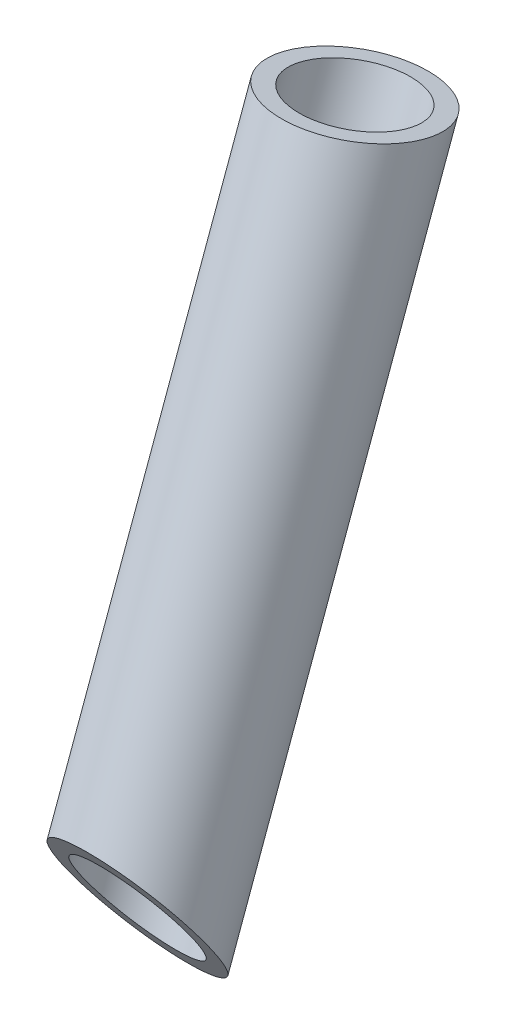
ISO-10303-21;
HEADER;
FILE_DESCRIPTION(('STEP AP214'),'2;1');
FILE_NAME('part.step','',(''),(''),'','','');
FILE_SCHEMA(('AUTOMOTIVE_DESIGN { 1 0 10303 214 1 1 1 1 }'));
ENDSEC;
DATA;
#1=APPLICATION_CONTEXT('core data for automotive mechanical design processes');
#2=APPLICATION_PROTOCOL_DEFINITION('international standard','automotive_design',2000,#1);
#3=PRODUCT_CONTEXT('',#1,'mechanical');
#4=PRODUCT('Part','Part','',(#3));
#5=PRODUCT_RELATED_PRODUCT_CATEGORY('part','',(#4));
#6=PRODUCT_DEFINITION_FORMATION('','',#4);
#7=PRODUCT_DEFINITION_CONTEXT('part definition',#1,'design');
#8=PRODUCT_DEFINITION('design','',#6,#7);
#9=PRODUCT_DEFINITION_SHAPE('','',#8);
#10=(LENGTH_UNIT() NAMED_UNIT(*) SI_UNIT(.MILLI.,.METRE.));
#11=(NAMED_UNIT(*) PLANE_ANGLE_UNIT() SI_UNIT($,.RADIAN.));
#12=(NAMED_UNIT(*) SI_UNIT($,.STERADIAN.) SOLID_ANGLE_UNIT());
#13=UNCERTAINTY_MEASURE_WITH_UNIT(LENGTH_MEASURE(1.E-05),#10,'distance_accuracy_value','');
#14=(GEOMETRIC_REPRESENTATION_CONTEXT(3) GLOBAL_UNCERTAINTY_ASSIGNED_CONTEXT((#13)) GLOBAL_UNIT_ASSIGNED_CONTEXT((#10,
#11,#12)) REPRESENTATION_CONTEXT('',''));
#15=CARTESIAN_POINT('',(0.,0.,0.));
#16=DIRECTION('',(0.,0.,1.));
#17=DIRECTION('',(1.,0.,0.));
#18=AXIS2_PLACEMENT_3D('',#15,#16,#17);
#19=CARTESIAN_POINT('',(899.196916053029,101.086343763392,-238.011921297441));
#20=DIRECTION('',(0.00743596247195737,-0.935984664475876,0.351962234235575));
#21=DIRECTION('',(0.,-0.35197196525769,-0.936010542500799));
#22=AXIS2_PLACEMENT_3D('',#19,#20,#21);
#23=CYLINDRICAL_SURFACE('',#22,9.65000000000004);
#24=CARTESIAN_POINT('',(899.196916053029,101.086343763392,-238.011921297441));
#25=DIRECTION('',(0.00143638782424152,-0.977156337317368,0.212516891635755));
#26=DIRECTION('',(0.0414428460712229,0.212392700268518,0.976305193769943));
#27=AXIS2_PLACEMENT_3D('',#24,#25,#26);
#28=ELLIPSE('',#27,9.75326811540505,9.65000000000004);
#29=CARTESIAN_POINT('',(899.601119242227,103.157866714865,-228.48975498014));
#30=VERTEX_POINT('',#29);
#31=EDGE_CURVE('E47',#30,#30,#28,.T.);
#32=ORIENTED_EDGE('',*,*,#31,.F.);
#33=EDGE_LOOP('',(#32));
#34=FACE_BOUND('',#33,.T.);
#35=CARTESIAN_POINT('',(900.,0.,-200.));
#36=DIRECTION('',(0.0045220973909886,-0.569208602813942,0.822180708310397));
#37=DIRECTION('',(0.00653163689339619,-0.822154763312406,-0.569226565509916));
#38=AXIS2_PLACEMENT_3D('',#35,#36,#37);
#39=ELLIPSE('',#38,11.7370790903511,9.65000000000004);
#40=CARTESIAN_POINT('',(900.076662338807,-9.64969548150654,-206.681057219719));
#41=VERTEX_POINT('',#40);
#42=EDGE_CURVE('E42',#41,#41,#39,.T.);
#43=ORIENTED_EDGE('',*,*,#42,.T.);
#44=EDGE_LOOP('',(#43));
#45=FACE_BOUND('',#44,.T.);
#46=ADVANCED_FACE('F38',(#34,#45),#23,.F.);
#47=CARTESIAN_POINT('',(899.196916053029,101.086343763392,-238.011921297441));
#48=DIRECTION('',(0.00743596247195737,-0.935984664475876,0.351962234235575));
#49=DIRECTION('',(0.,-0.35197196525769,-0.936010542500799));
#50=AXIS2_PLACEMENT_3D('',#47,#48,#49);
#51=CYLINDRICAL_SURFACE('',#50,12.7);
#52=CARTESIAN_POINT('',(899.196916053029,101.086343763392,-238.011921297441));
#53=DIRECTION('',(0.00143638782424152,-0.977156337317368,0.212516891635755));
#54=DIRECTION('',(0.0414428460712229,0.212392700268518,0.976305193769943));
#55=AXIS2_PLACEMENT_3D('',#52,#53,#54);
#56=ELLIPSE('',#55,12.8359072606885,12.7);
#57=CARTESIAN_POINT('',(899.728872581818,103.812596766886,-225.480158372082));
#58=VERTEX_POINT('',#57);
#59=EDGE_CURVE('E53',#58,#58,#56,.T.);
#60=ORIENTED_EDGE('',*,*,#59,.T.);
#61=EDGE_LOOP('',(#60));
#62=FACE_BOUND('',#61,.T.);
#63=CARTESIAN_POINT('',(900.,0.,-200.));
#64=DIRECTION('',(0.0045220973909886,-0.569208602813942,0.822180708310397));
#65=DIRECTION('',(0.00653163689339619,-0.822154763312406,-0.569226565509916));
#66=AXIS2_PLACEMENT_3D('',#63,#64,#65);
#67=ELLIPSE('',#66,15.4467258494776,12.7);
#68=CARTESIAN_POINT('',(900.100892404441,-12.6995992347288,-208.792686703671));
#69=VERTEX_POINT('',#68);
#70=EDGE_CURVE('E10',#69,#69,#67,.T.);
#71=ORIENTED_EDGE('',*,*,#70,.F.);
#72=EDGE_LOOP('',(#71));
#73=FACE_BOUND('',#72,.T.);
#74=ADVANCED_FACE('F72',(#62,#73),#51,.T.);
#75=CARTESIAN_POINT('',(899.196916053029,101.086343763392,-238.011921297441));
#76=DIRECTION('',(0.00143638782424152,-0.977156337317368,0.212516891635755));
#77=DIRECTION('',(0.,-0.21251711086958,-0.977157345358283));
#78=AXIS2_PLACEMENT_3D('',#75,#76,#77);
#79=PLANE('',#78);
#80=ORIENTED_EDGE('',*,*,#31,.T.);
#81=EDGE_LOOP('',(#80));
#82=FACE_BOUND('',#81,.T.);
#83=ORIENTED_EDGE('',*,*,#59,.F.);
#84=EDGE_LOOP('',(#83));
#85=FACE_BOUND('',#84,.T.);
#86=ADVANCED_FACE('F68',(#82,#85),#79,.F.);
#87=CARTESIAN_POINT('',(900.,0.,-200.));
#88=DIRECTION('',(0.0045220973909886,-0.569208602813942,0.822180708310397));
#89=DIRECTION('',(0.,-0.822189114975954,-0.569214422880393));
#90=AXIS2_PLACEMENT_3D('',#87,#88,#89);
#91=PLANE('',#90);
#92=ORIENTED_EDGE('',*,*,#42,.F.);
#93=EDGE_LOOP('',(#92));
#94=FACE_BOUND('',#93,.T.);
#95=ORIENTED_EDGE('',*,*,#70,.T.);
#96=EDGE_LOOP('',(#95));
#97=FACE_BOUND('',#96,.T.);
#98=ADVANCED_FACE('F40',(#94,#97),#91,.T.);
#99=CLOSED_SHELL('',(#46,#74,#86,#98));
#100=MANIFOLD_SOLID_BREP('B2',#99);
#101=ADVANCED_BREP_SHAPE_REPRESENTATION('',(#18,#100),#14);
#102=SHAPE_DEFINITION_REPRESENTATION(#9,#101);
ENDSEC;
END-ISO-10303-21;
